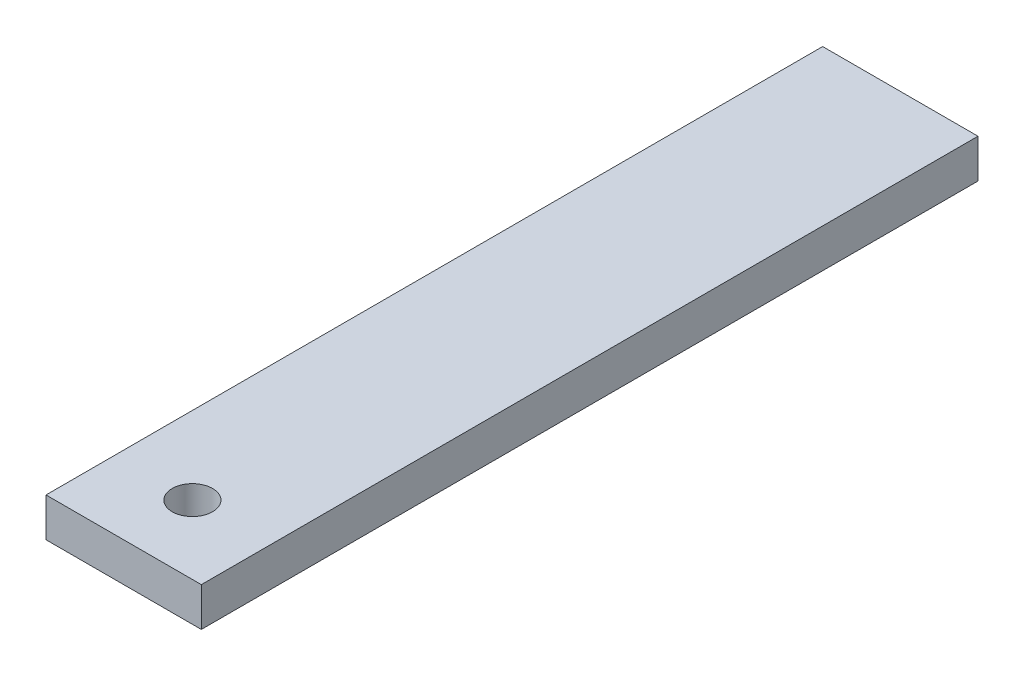
ISO-10303-21;
HEADER;
FILE_DESCRIPTION(('STEP AP214'),'2;1');
FILE_NAME('part.step','',(''),(''),'','','');
FILE_SCHEMA(('AUTOMOTIVE_DESIGN { 1 0 10303 214 1 1 1 1 }'));
ENDSEC;
DATA;
#1=APPLICATION_CONTEXT('core data for automotive mechanical design processes');
#2=APPLICATION_PROTOCOL_DEFINITION('international standard','automotive_design',2000,#1);
#3=PRODUCT_CONTEXT('',#1,'mechanical');
#4=PRODUCT('Part','Part','',(#3));
#5=PRODUCT_RELATED_PRODUCT_CATEGORY('part','',(#4));
#6=PRODUCT_DEFINITION_FORMATION('','',#4);
#7=PRODUCT_DEFINITION_CONTEXT('part definition',#1,'design');
#8=PRODUCT_DEFINITION('design','',#6,#7);
#9=PRODUCT_DEFINITION_SHAPE('','',#8);
#10=(LENGTH_UNIT() NAMED_UNIT(*) SI_UNIT(.MILLI.,.METRE.));
#11=(NAMED_UNIT(*) PLANE_ANGLE_UNIT() SI_UNIT($,.RADIAN.));
#12=(NAMED_UNIT(*) SI_UNIT($,.STERADIAN.) SOLID_ANGLE_UNIT());
#13=UNCERTAINTY_MEASURE_WITH_UNIT(LENGTH_MEASURE(1.E-05),#10,'distance_accuracy_value','');
#14=(GEOMETRIC_REPRESENTATION_CONTEXT(3) GLOBAL_UNCERTAINTY_ASSIGNED_CONTEXT((#13)) GLOBAL_UNIT_ASSIGNED_CONTEXT((#10,
#11,#12)) REPRESENTATION_CONTEXT('',''));
#15=CARTESIAN_POINT('',(0.,0.,0.));
#16=DIRECTION('',(0.,0.,1.));
#17=DIRECTION('',(1.,0.,0.));
#18=AXIS2_PLACEMENT_3D('',#15,#16,#17);
#19=CARTESIAN_POINT('',(0.,6.35,0.));
#20=DIRECTION('',(0.,-1.,0.));
#21=DIRECTION('',(0.,0.,-1.));
#22=AXIS2_PLACEMENT_3D('',#19,#20,#21);
#23=PLANE('',#22);
#24=DIRECTION('',(0.,0.,1.));
#25=VECTOR('',#24,1.);
#26=CARTESIAN_POINT('',(0.,6.35,0.));
#27=LINE('',#26,#25);
#28=CARTESIAN_POINT('',(0.,6.35,-127.));
#29=VERTEX_POINT('',#28);
#30=CARTESIAN_POINT('',(0.,6.35,0.));
#31=VERTEX_POINT('',#30);
#32=EDGE_CURVE('E85',#29,#31,#27,.T.);
#33=ORIENTED_EDGE('',*,*,#32,.T.);
#34=DIRECTION('',(1.,0.,0.));
#35=VECTOR('',#34,1.);
#36=CARTESIAN_POINT('',(0.,6.35,0.));
#37=LINE('',#36,#35);
#38=CARTESIAN_POINT('',(25.4,6.35,0.));
#39=VERTEX_POINT('',#38);
#40=EDGE_CURVE('E80',#31,#39,#37,.T.);
#41=ORIENTED_EDGE('',*,*,#40,.T.);
#42=DIRECTION('',(0.,0.,-1.));
#43=VECTOR('',#42,1.);
#44=CARTESIAN_POINT('',(25.4,6.35,0.));
#45=LINE('',#44,#43);
#46=CARTESIAN_POINT('',(25.4,6.35,-127.));
#47=VERTEX_POINT('',#46);
#48=EDGE_CURVE('E83',#39,#47,#45,.T.);
#49=ORIENTED_EDGE('',*,*,#48,.T.);
#50=DIRECTION('',(-1.,0.,0.));
#51=VECTOR('',#50,1.);
#52=CARTESIAN_POINT('',(0.,6.35,-127.));
#53=LINE('',#52,#51);
#54=EDGE_CURVE('E50',#47,#29,#53,.T.);
#55=ORIENTED_EDGE('',*,*,#54,.T.);
#56=EDGE_LOOP('',(#33,#41,#49,#55));
#57=FACE_BOUND('',#56,.T.);
#58=CARTESIAN_POINT('',(12.7,6.35,-11.2387498704895));
#59=DIRECTION('',(0.,1.,0.));
#60=DIRECTION('',(0.,0.,1.));
#61=AXIS2_PLACEMENT_3D('',#58,#59,#60);
#62=CIRCLE('',#61,3.302);
#63=CARTESIAN_POINT('',(12.7,6.35,-7.93674987048946));
#64=VERTEX_POINT('',#63);
#65=EDGE_CURVE('E100',#64,#64,#62,.T.);
#66=ORIENTED_EDGE('',*,*,#65,.F.);
#67=EDGE_LOOP('',(#66));
#68=FACE_BOUND('',#67,.T.);
#69=ADVANCED_FACE('F33',(#57,#68),#23,.F.);
#70=CARTESIAN_POINT('',(0.,0.,0.));
#71=DIRECTION('',(0.,-1.,0.));
#72=DIRECTION('',(0.,0.,-1.));
#73=AXIS2_PLACEMENT_3D('',#70,#71,#72);
#74=PLANE('',#73);
#75=DIRECTION('',(0.,0.,1.));
#76=VECTOR('',#75,1.);
#77=CARTESIAN_POINT('',(0.,0.,0.));
#78=LINE('',#77,#76);
#79=CARTESIAN_POINT('',(0.,0.,-127.));
#80=VERTEX_POINT('',#79);
#81=CARTESIAN_POINT('',(0.,0.,0.));
#82=VERTEX_POINT('',#81);
#83=EDGE_CURVE('E97',#80,#82,#78,.T.);
#84=ORIENTED_EDGE('',*,*,#83,.F.);
#85=DIRECTION('',(-1.,0.,0.));
#86=VECTOR('',#85,1.);
#87=CARTESIAN_POINT('',(0.,0.,-127.));
#88=LINE('',#87,#86);
#89=CARTESIAN_POINT('',(25.4,0.,-127.));
#90=VERTEX_POINT('',#89);
#91=EDGE_CURVE('E73',#90,#80,#88,.T.);
#92=ORIENTED_EDGE('',*,*,#91,.F.);
#93=DIRECTION('',(0.,0.,-1.));
#94=VECTOR('',#93,1.);
#95=CARTESIAN_POINT('',(25.4,0.,0.));
#96=LINE('',#95,#94);
#97=CARTESIAN_POINT('',(25.4,0.,0.));
#98=VERTEX_POINT('',#97);
#99=EDGE_CURVE('E67',#98,#90,#96,.T.);
#100=ORIENTED_EDGE('',*,*,#99,.F.);
#101=DIRECTION('',(1.,0.,0.));
#102=VECTOR('',#101,1.);
#103=CARTESIAN_POINT('',(0.,0.,0.));
#104=LINE('',#103,#102);
#105=EDGE_CURVE('E89',#82,#98,#104,.T.);
#106=ORIENTED_EDGE('',*,*,#105,.F.);
#107=EDGE_LOOP('',(#84,#92,#100,#106));
#108=FACE_BOUND('',#107,.T.);
#109=CARTESIAN_POINT('',(12.7,0.,-11.2387498704895));
#110=DIRECTION('',(0.,1.,0.));
#111=DIRECTION('',(0.,0.,1.));
#112=AXIS2_PLACEMENT_3D('',#109,#110,#111);
#113=CIRCLE('',#112,3.302);
#114=CARTESIAN_POINT('',(12.7,0.,-7.93674987048946));
#115=VERTEX_POINT('',#114);
#116=EDGE_CURVE('E112',#115,#115,#113,.T.);
#117=ORIENTED_EDGE('',*,*,#116,.T.);
#118=EDGE_LOOP('',(#117));
#119=FACE_BOUND('',#118,.T.);
#120=ADVANCED_FACE('F108',(#108,#119),#74,.T.);
#121=CARTESIAN_POINT('',(0.,6.35,0.));
#122=DIRECTION('',(1.,0.,0.));
#123=DIRECTION('',(0.,0.,-1.));
#124=AXIS2_PLACEMENT_3D('',#121,#122,#123);
#125=PLANE('',#124);
#126=ORIENTED_EDGE('',*,*,#83,.T.);
#127=DIRECTION('',(0.,-1.,0.));
#128=VECTOR('',#127,1.);
#129=CARTESIAN_POINT('',(0.,6.35,0.));
#130=LINE('',#129,#128);
#131=EDGE_CURVE('E11',#31,#82,#130,.T.);
#132=ORIENTED_EDGE('',*,*,#131,.F.);
#133=ORIENTED_EDGE('',*,*,#32,.F.);
#134=DIRECTION('',(0.,-1.,0.));
#135=VECTOR('',#134,1.);
#136=CARTESIAN_POINT('',(0.,6.35,-127.));
#137=LINE('',#136,#135);
#138=EDGE_CURVE('E93',#29,#80,#137,.T.);
#139=ORIENTED_EDGE('',*,*,#138,.T.);
#140=EDGE_LOOP('',(#126,#132,#133,#139));
#141=FACE_BOUND('',#140,.T.);
#142=ADVANCED_FACE('F35',(#141),#125,.F.);
#143=CARTESIAN_POINT('',(0.,6.35,0.));
#144=DIRECTION('',(0.,0.,-1.));
#145=DIRECTION('',(-1.,0.,0.));
#146=AXIS2_PLACEMENT_3D('',#143,#144,#145);
#147=PLANE('',#146);
#148=ORIENTED_EDGE('',*,*,#105,.T.);
#149=DIRECTION('',(0.,-1.,0.));
#150=VECTOR('',#149,1.);
#151=CARTESIAN_POINT('',(25.4,6.35,0.));
#152=LINE('',#151,#150);
#153=EDGE_CURVE('E42',#39,#98,#152,.T.);
#154=ORIENTED_EDGE('',*,*,#153,.F.);
#155=ORIENTED_EDGE('',*,*,#40,.F.);
#156=ORIENTED_EDGE('',*,*,#131,.T.);
#157=EDGE_LOOP('',(#148,#154,#155,#156));
#158=FACE_BOUND('',#157,.T.);
#159=ADVANCED_FACE('F88',(#158),#147,.F.);
#160=CARTESIAN_POINT('',(25.4,6.35,0.));
#161=DIRECTION('',(-1.,0.,0.));
#162=DIRECTION('',(0.,0.,1.));
#163=AXIS2_PLACEMENT_3D('',#160,#161,#162);
#164=PLANE('',#163);
#165=ORIENTED_EDGE('',*,*,#99,.T.);
#166=DIRECTION('',(0.,-1.,0.));
#167=VECTOR('',#166,1.);
#168=CARTESIAN_POINT('',(25.4,6.35,-127.));
#169=LINE('',#168,#167);
#170=EDGE_CURVE('E90',#47,#90,#169,.T.);
#171=ORIENTED_EDGE('',*,*,#170,.F.);
#172=ORIENTED_EDGE('',*,*,#48,.F.);
#173=ORIENTED_EDGE('',*,*,#153,.T.);
#174=EDGE_LOOP('',(#165,#171,#172,#173));
#175=FACE_BOUND('',#174,.T.);
#176=ADVANCED_FACE('F91',(#175),#164,.F.);
#177=CARTESIAN_POINT('',(0.,6.35,-127.));
#178=DIRECTION('',(0.,0.,1.));
#179=DIRECTION('',(1.,0.,0.));
#180=AXIS2_PLACEMENT_3D('',#177,#178,#179);
#181=PLANE('',#180);
#182=ORIENTED_EDGE('',*,*,#91,.T.);
#183=ORIENTED_EDGE('',*,*,#138,.F.);
#184=ORIENTED_EDGE('',*,*,#54,.F.);
#185=ORIENTED_EDGE('',*,*,#170,.T.);
#186=EDGE_LOOP('',(#182,#183,#184,#185));
#187=FACE_BOUND('',#186,.T.);
#188=ADVANCED_FACE('F105',(#187),#181,.F.);
#189=CARTESIAN_POINT('',(12.7,6.35,-11.2387498704895));
#190=DIRECTION('',(0.,-1.,0.));
#191=DIRECTION('',(0.,0.,-1.));
#192=AXIS2_PLACEMENT_3D('',#189,#190,#191);
#193=CYLINDRICAL_SURFACE('',#192,3.302);
#194=ORIENTED_EDGE('',*,*,#65,.T.);
#195=EDGE_LOOP('',(#194));
#196=FACE_BOUND('',#195,.T.);
#197=ORIENTED_EDGE('',*,*,#116,.F.);
#198=EDGE_LOOP('',(#197));
#199=FACE_BOUND('',#198,.T.);
#200=ADVANCED_FACE('F118',(#196,#199),#193,.F.);
#201=CLOSED_SHELL('',(#69,#120,#142,#159,#176,#188,#200));
#202=MANIFOLD_SOLID_BREP('B2',#201);
#203=ADVANCED_BREP_SHAPE_REPRESENTATION('',(#18,#202),#14);
#204=SHAPE_DEFINITION_REPRESENTATION(#9,#203);
ENDSEC;
END-ISO-10303-21;
